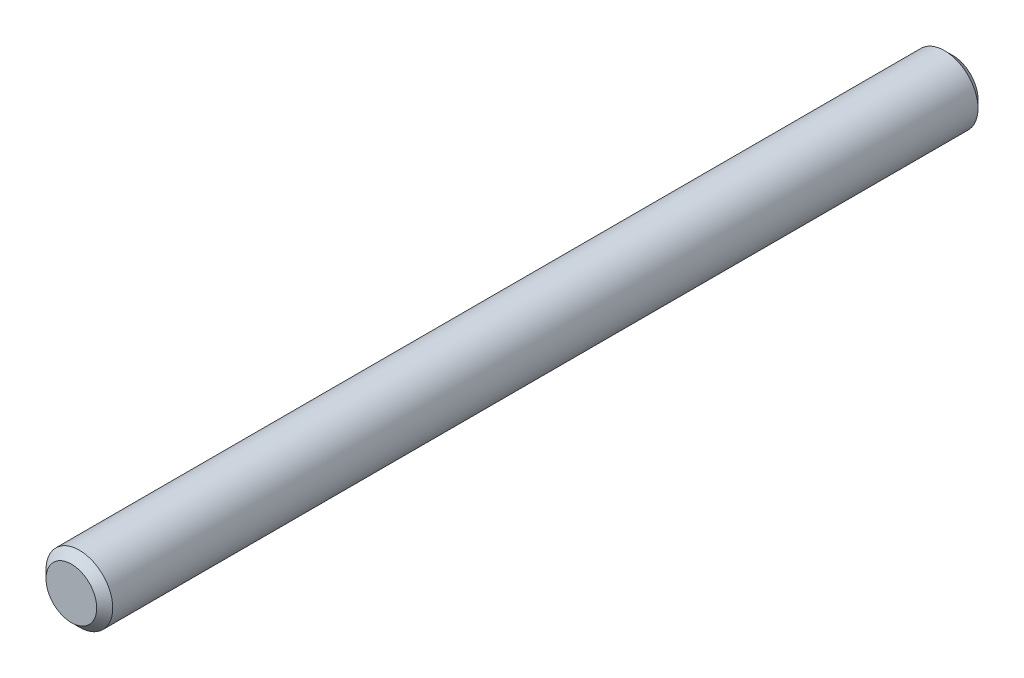
ISO-10303-21;
HEADER;
FILE_DESCRIPTION(('STEP AP214'),'2;1');
FILE_NAME('part.step','',(''),(''),'','','');
FILE_SCHEMA(('AUTOMOTIVE_DESIGN { 1 0 10303 214 1 1 1 1 }'));
ENDSEC;
DATA;
#1=APPLICATION_CONTEXT('core data for automotive mechanical design processes');
#2=APPLICATION_PROTOCOL_DEFINITION('international standard','automotive_design',2000,#1);
#3=PRODUCT_CONTEXT('',#1,'mechanical');
#4=PRODUCT('Part','Part','',(#3));
#5=PRODUCT_RELATED_PRODUCT_CATEGORY('part','',(#4));
#6=PRODUCT_DEFINITION_FORMATION('','',#4);
#7=PRODUCT_DEFINITION_CONTEXT('part definition',#1,'design');
#8=PRODUCT_DEFINITION('design','',#6,#7);
#9=PRODUCT_DEFINITION_SHAPE('','',#8);
#10=(LENGTH_UNIT() NAMED_UNIT(*) SI_UNIT(.MILLI.,.METRE.));
#11=(NAMED_UNIT(*) PLANE_ANGLE_UNIT() SI_UNIT($,.RADIAN.));
#12=(NAMED_UNIT(*) SI_UNIT($,.STERADIAN.) SOLID_ANGLE_UNIT());
#13=UNCERTAINTY_MEASURE_WITH_UNIT(LENGTH_MEASURE(1.E-05),#10,'distance_accuracy_value','');
#14=(GEOMETRIC_REPRESENTATION_CONTEXT(3) GLOBAL_UNCERTAINTY_ASSIGNED_CONTEXT((#13)) GLOBAL_UNIT_ASSIGNED_CONTEXT((#10,
#11,#12)) REPRESENTATION_CONTEXT('',''));
#15=CARTESIAN_POINT('',(0.,0.,0.));
#16=DIRECTION('',(0.,0.,1.));
#17=DIRECTION('',(1.,0.,0.));
#18=AXIS2_PLACEMENT_3D('',#15,#16,#17);
#19=CARTESIAN_POINT('',(0.,0.,165.));
#20=DIRECTION('',(0.,0.,-1.));
#21=DIRECTION('',(-1.,0.,0.));
#22=AXIS2_PLACEMENT_3D('',#19,#20,#21);
#23=CYLINDRICAL_SURFACE('',#22,12.5);
#24=CARTESIAN_POINT('',(0.,0.,-162.));
#25=DIRECTION('',(0.,0.,1.));
#26=DIRECTION('',(1.,0.,0.));
#27=AXIS2_PLACEMENT_3D('',#24,#25,#26);
#28=CIRCLE('',#27,12.5);
#29=CARTESIAN_POINT('',(12.5,0.,-162.));
#30=VERTEX_POINT('',#29);
#31=EDGE_CURVE('E51',#30,#30,#28,.T.);
#32=ORIENTED_EDGE('',*,*,#31,.T.);
#33=EDGE_LOOP('',(#32));
#34=FACE_BOUND('',#33,.T.);
#35=CARTESIAN_POINT('',(0.,0.,162.));
#36=DIRECTION('',(0.,0.,1.));
#37=DIRECTION('',(1.,0.,0.));
#38=AXIS2_PLACEMENT_3D('',#35,#36,#37);
#39=CIRCLE('',#38,12.5);
#40=CARTESIAN_POINT('',(12.5,0.,162.));
#41=VERTEX_POINT('',#40);
#42=EDGE_CURVE('E55',#41,#41,#39,.F.);
#43=ORIENTED_EDGE('',*,*,#42,.T.);
#44=EDGE_LOOP('',(#43));
#45=FACE_BOUND('',#44,.T.);
#46=ADVANCED_FACE('F39',(#34,#45),#23,.T.);
#47=CARTESIAN_POINT('',(0.,0.,165.));
#48=DIRECTION('',(0.,0.,1.));
#49=DIRECTION('',(1.,0.,0.));
#50=AXIS2_PLACEMENT_3D('',#47,#48,#49);
#51=PLANE('',#50);
#52=CARTESIAN_POINT('',(0.,0.,165.));
#53=DIRECTION('',(0.,0.,1.));
#54=DIRECTION('',(1.,0.,0.));
#55=AXIS2_PLACEMENT_3D('',#52,#53,#54);
#56=CIRCLE('',#55,9.49999999999995);
#57=CARTESIAN_POINT('',(9.49999999999995,0.,165.));
#58=VERTEX_POINT('',#57);
#59=EDGE_CURVE('E10',#58,#58,#56,.T.);
#60=ORIENTED_EDGE('',*,*,#59,.T.);
#61=EDGE_LOOP('',(#60));
#62=FACE_BOUND('',#61,.T.);
#63=ADVANCED_FACE('F71',(#62),#51,.T.);
#64=CARTESIAN_POINT('',(0.,0.,-165.));
#65=DIRECTION('',(0.,0.,1.));
#66=DIRECTION('',(1.,0.,0.));
#67=AXIS2_PLACEMENT_3D('',#64,#65,#66);
#68=PLANE('',#67);
#69=CARTESIAN_POINT('',(0.,0.,-165.));
#70=DIRECTION('',(0.,0.,1.));
#71=DIRECTION('',(1.,0.,0.));
#72=AXIS2_PLACEMENT_3D('',#69,#70,#71);
#73=CIRCLE('',#72,9.49999999999993);
#74=CARTESIAN_POINT('',(9.49999999999993,0.,-165.));
#75=VERTEX_POINT('',#74);
#76=EDGE_CURVE('E47',#75,#75,#73,.F.);
#77=ORIENTED_EDGE('',*,*,#76,.T.);
#78=EDGE_LOOP('',(#77));
#79=FACE_BOUND('',#78,.T.);
#80=ADVANCED_FACE('F68',(#79),#68,.F.);
#81=CARTESIAN_POINT('',(0.,0.,-162.));
#82=DIRECTION('',(0.,0.,1.));
#83=DIRECTION('',(1.,0.,0.));
#84=AXIS2_PLACEMENT_3D('',#81,#82,#83);
#85=CONICAL_SURFACE('',#84,12.5,0.785398163397451);
#86=ORIENTED_EDGE('',*,*,#76,.F.);
#87=EDGE_LOOP('',(#86));
#88=FACE_BOUND('',#87,.T.);
#89=ORIENTED_EDGE('',*,*,#31,.F.);
#90=EDGE_LOOP('',(#89));
#91=FACE_BOUND('',#90,.T.);
#92=ADVANCED_FACE('F64',(#88,#91),#85,.T.);
#93=CARTESIAN_POINT('',(0.,0.,165.));
#94=DIRECTION('',(0.,0.,-1.));
#95=DIRECTION('',(-1.,0.,0.));
#96=AXIS2_PLACEMENT_3D('',#93,#94,#95);
#97=CONICAL_SURFACE('',#96,9.49999999999995,0.785398163397451);
#98=ORIENTED_EDGE('',*,*,#42,.F.);
#99=EDGE_LOOP('',(#98));
#100=FACE_BOUND('',#99,.T.);
#101=ORIENTED_EDGE('',*,*,#59,.F.);
#102=EDGE_LOOP('',(#101));
#103=FACE_BOUND('',#102,.T.);
#104=ADVANCED_FACE('F42',(#100,#103),#97,.T.);
#105=CLOSED_SHELL('',(#46,#63,#80,#92,#104));
#106=MANIFOLD_SOLID_BREP('B2',#105);
#107=ADVANCED_BREP_SHAPE_REPRESENTATION('',(#18,#106),#14);
#108=SHAPE_DEFINITION_REPRESENTATION(#9,#107);
ENDSEC;
END-ISO-10303-21;
